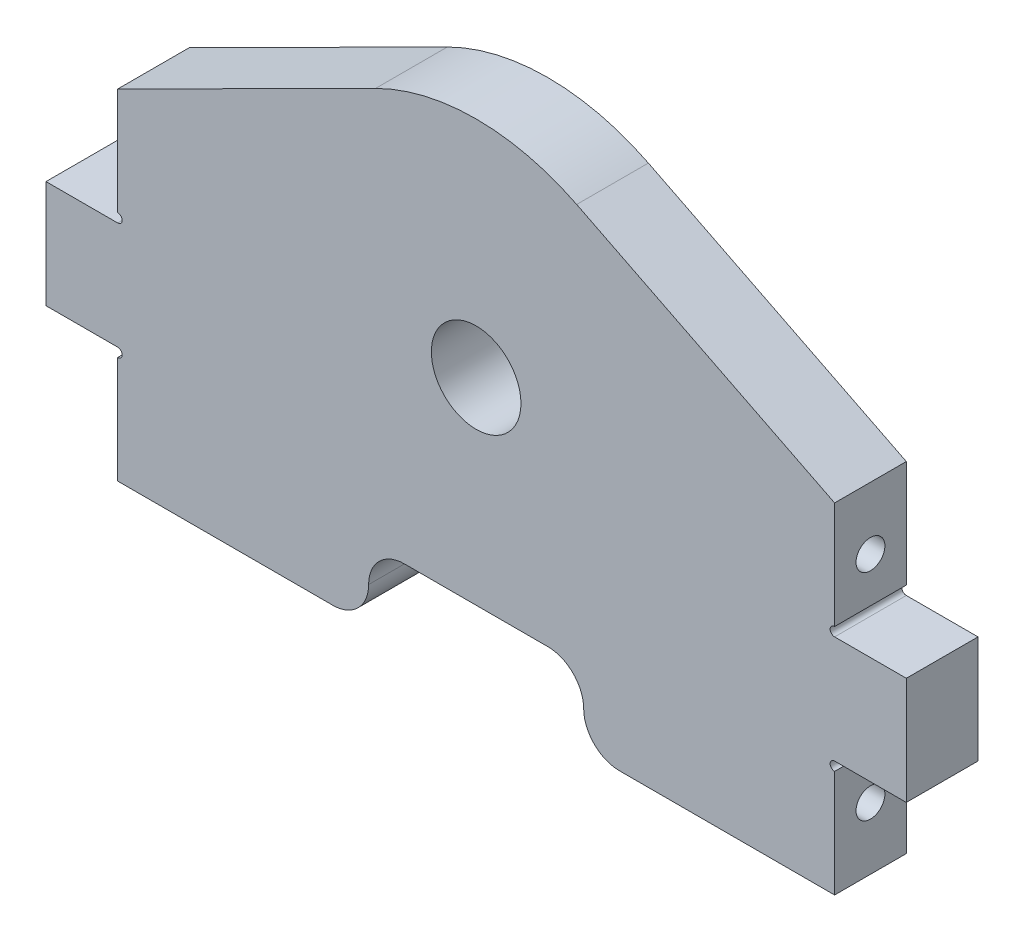
ISO-10303-21;
HEADER;
FILE_DESCRIPTION(('STEP AP214'),'2;1');
FILE_NAME('part.step','',(''),(''),'','','');
FILE_SCHEMA(('AUTOMOTIVE_DESIGN { 1 0 10303 214 1 1 1 1 }'));
ENDSEC;
DATA;
#1=APPLICATION_CONTEXT('core data for automotive mechanical design processes');
#2=APPLICATION_PROTOCOL_DEFINITION('international standard','automotive_design',2000,#1);
#3=PRODUCT_CONTEXT('',#1,'mechanical');
#4=PRODUCT('Part','Part','',(#3));
#5=PRODUCT_RELATED_PRODUCT_CATEGORY('part','',(#4));
#6=PRODUCT_DEFINITION_FORMATION('','',#4);
#7=PRODUCT_DEFINITION_CONTEXT('part definition',#1,'design');
#8=PRODUCT_DEFINITION('design','',#6,#7);
#9=PRODUCT_DEFINITION_SHAPE('','',#8);
#10=(LENGTH_UNIT() NAMED_UNIT(*) SI_UNIT(.MILLI.,.METRE.));
#11=(NAMED_UNIT(*) PLANE_ANGLE_UNIT() SI_UNIT($,.RADIAN.));
#12=(NAMED_UNIT(*) SI_UNIT($,.STERADIAN.) SOLID_ANGLE_UNIT());
#13=UNCERTAINTY_MEASURE_WITH_UNIT(LENGTH_MEASURE(1.E-05),#10,'distance_accuracy_value','');
#14=(GEOMETRIC_REPRESENTATION_CONTEXT(3) GLOBAL_UNCERTAINTY_ASSIGNED_CONTEXT((#13)) GLOBAL_UNIT_ASSIGNED_CONTEXT((#10,
#11,#12)) REPRESENTATION_CONTEXT('',''));
#15=CARTESIAN_POINT('',(0.,0.,0.));
#16=DIRECTION('',(0.,0.,1.));
#17=DIRECTION('',(1.,0.,0.));
#18=AXIS2_PLACEMENT_3D('',#15,#16,#17);
#19=CARTESIAN_POINT('',(0.,0.,12.7));
#20=DIRECTION('',(0.,0.,-1.));
#21=DIRECTION('',(-1.,0.,0.));
#22=AXIS2_PLACEMENT_3D('',#19,#20,#21);
#23=PLANE('',#22);
#24=CARTESIAN_POINT('',(-1.11022302462516E-13,44.45,12.7));
#25=DIRECTION('',(0.,0.,1.));
#26=DIRECTION('',(1.,0.,0.));
#27=AXIS2_PLACEMENT_3D('',#24,#25,#26);
#28=CIRCLE('',#27,7.9375);
#29=CARTESIAN_POINT('',(7.93749999999989,44.45,12.7));
#30=VERTEX_POINT('',#29);
#31=EDGE_CURVE('E350',#30,#30,#28,.T.);
#32=ORIENTED_EDGE('',*,*,#31,.F.);
#33=EDGE_LOOP('',(#32));
#34=FACE_BOUND('',#33,.T.);
#35=CARTESIAN_POINT('',(-63.5,16.5822501190821,12.7));
#36=DIRECTION('',(0.,0.,-1.));
#37=DIRECTION('',(-1.,0.,0.));
#38=AXIS2_PLACEMENT_3D('',#35,#36,#37);
#39=CIRCLE('',#38,0.793749999999993);
#40=CARTESIAN_POINT('',(-63.5,17.3760001190821,12.7));
#41=VERTEX_POINT('',#40);
#42=CARTESIAN_POINT('',(-63.5,15.7885001190821,12.7));
#43=VERTEX_POINT('',#42);
#44=EDGE_CURVE('E214',#41,#43,#39,.T.);
#45=ORIENTED_EDGE('',*,*,#44,.T.);
#46=DIRECTION('',(0.,-1.,0.));
#47=VECTOR('',#46,1.);
#48=CARTESIAN_POINT('',(-63.5,0.,12.7));
#49=LINE('',#48,#47);
#50=CARTESIAN_POINT('',(-63.5000000000001,-3.17500000000002,12.7));
#51=VERTEX_POINT('',#50);
#52=EDGE_CURVE('E225',#43,#51,#49,.T.);
#53=ORIENTED_EDGE('',*,*,#52,.T.);
#54=DIRECTION('',(-1.,0.,0.));
#55=VECTOR('',#54,1.);
#56=CARTESIAN_POINT('',(63.5,-3.17500000000002,12.7));
#57=LINE('',#56,#55);
#58=CARTESIAN_POINT('',(-25.4,-3.17500000000002,12.7));
#59=VERTEX_POINT('',#58);
#60=EDGE_CURVE('E345',#59,#51,#57,.T.);
#61=ORIENTED_EDGE('',*,*,#60,.F.);
#62=CARTESIAN_POINT('',(-25.4,3.17499999999998,12.7));
#63=DIRECTION('',(0.,0.,-1.));
#64=DIRECTION('',(-1.,0.,0.));
#65=AXIS2_PLACEMENT_3D('',#62,#63,#64);
#66=CIRCLE('',#65,6.35);
#67=CARTESIAN_POINT('',(-19.05,3.17499999999997,12.7));
#68=VERTEX_POINT('',#67);
#69=EDGE_CURVE('E402',#59,#68,#66,.F.);
#70=ORIENTED_EDGE('',*,*,#69,.T.);
#71=CARTESIAN_POINT('',(-12.7,3.17499999999998,12.7));
#72=DIRECTION('',(0.,0.,-1.));
#73=DIRECTION('',(-1.,0.,0.));
#74=AXIS2_PLACEMENT_3D('',#71,#72,#73);
#75=CIRCLE('',#74,6.35);
#76=CARTESIAN_POINT('',(-12.7,9.52499999999998,12.7));
#77=VERTEX_POINT('',#76);
#78=EDGE_CURVE('E416',#68,#77,#75,.T.);
#79=ORIENTED_EDGE('',*,*,#78,.T.);
#80=DIRECTION('',(-1.,0.,0.));
#81=VECTOR('',#80,1.);
#82=CARTESIAN_POINT('',(-19.05,9.52499999999998,12.7));
#83=LINE('',#82,#81);
#84=CARTESIAN_POINT('',(12.7,9.52499999999998,12.7));
#85=VERTEX_POINT('',#84);
#86=EDGE_CURVE('E338',#85,#77,#83,.T.);
#87=ORIENTED_EDGE('',*,*,#86,.F.);
#88=CARTESIAN_POINT('',(12.7,3.17499999999998,12.7));
#89=DIRECTION('',(0.,0.,-1.));
#90=DIRECTION('',(-1.,0.,0.));
#91=AXIS2_PLACEMENT_3D('',#88,#89,#90);
#92=CIRCLE('',#91,6.35);
#93=CARTESIAN_POINT('',(19.05,3.17499999999998,12.7));
#94=VERTEX_POINT('',#93);
#95=EDGE_CURVE('E45',#85,#94,#92,.T.);
#96=ORIENTED_EDGE('',*,*,#95,.T.);
#97=CARTESIAN_POINT('',(25.4,3.17499999999998,12.7));
#98=DIRECTION('',(0.,0.,-1.));
#99=DIRECTION('',(-1.,0.,0.));
#100=AXIS2_PLACEMENT_3D('',#97,#98,#99);
#101=CIRCLE('',#100,6.35);
#102=CARTESIAN_POINT('',(25.4,-3.17500000000002,12.7));
#103=VERTEX_POINT('',#102);
#104=EDGE_CURVE('E398',#94,#103,#101,.F.);
#105=ORIENTED_EDGE('',*,*,#104,.T.);
#106=CARTESIAN_POINT('',(63.5,-3.17500000000002,12.7));
#107=VERTEX_POINT('',#106);
#108=EDGE_CURVE('E341',#107,#103,#57,.T.);
#109=ORIENTED_EDGE('',*,*,#108,.F.);
#110=DIRECTION('',(0.,1.,0.));
#111=VECTOR('',#110,1.);
#112=CARTESIAN_POINT('',(63.5,0.,12.7));
#113=LINE('',#112,#111);
#114=CARTESIAN_POINT('',(63.5,15.7885001190821,12.7));
#115=VERTEX_POINT('',#114);
#116=EDGE_CURVE('E274',#107,#115,#113,.T.);
#117=ORIENTED_EDGE('',*,*,#116,.T.);
#118=CARTESIAN_POINT('',(63.5,16.5822501190821,12.7));
#119=DIRECTION('',(0.,0.,1.));
#120=DIRECTION('',(1.,0.,0.));
#121=AXIS2_PLACEMENT_3D('',#118,#119,#120);
#122=CIRCLE('',#121,0.793749999999993);
#123=CARTESIAN_POINT('',(63.5,17.3760001190821,12.7));
#124=VERTEX_POINT('',#123);
#125=EDGE_CURVE('E445',#124,#115,#122,.T.);
#126=ORIENTED_EDGE('',*,*,#125,.F.);
#127=DIRECTION('',(-1.,0.,0.));
#128=VECTOR('',#127,1.);
#129=CARTESIAN_POINT('',(76.2,17.3760001190821,12.7));
#130=LINE('',#129,#128);
#131=CARTESIAN_POINT('',(76.2,17.3760001190821,12.7));
#132=VERTEX_POINT('',#131);
#133=EDGE_CURVE('E311',#132,#124,#130,.T.);
#134=ORIENTED_EDGE('',*,*,#133,.F.);
#135=DIRECTION('',(0.,-1.,0.));
#136=VECTOR('',#135,1.);
#137=CARTESIAN_POINT('',(76.2,17.3760001190821,12.7));
#138=LINE('',#137,#136);
#139=CARTESIAN_POINT('',(76.2,36.4260001190821,12.7));
#140=VERTEX_POINT('',#139);
#141=EDGE_CURVE('E296',#140,#132,#138,.T.);
#142=ORIENTED_EDGE('',*,*,#141,.F.);
#143=DIRECTION('',(-1.,0.,0.));
#144=VECTOR('',#143,1.);
#145=CARTESIAN_POINT('',(76.2,36.4260001190821,12.7));
#146=LINE('',#145,#144);
#147=CARTESIAN_POINT('',(63.5,36.4260001190821,12.7));
#148=VERTEX_POINT('',#147);
#149=EDGE_CURVE('E299',#140,#148,#146,.T.);
#150=ORIENTED_EDGE('',*,*,#149,.T.);
#151=CARTESIAN_POINT('',(63.5,37.2197501190821,12.7));
#152=DIRECTION('',(0.,0.,1.));
#153=DIRECTION('',(1.,0.,0.));
#154=AXIS2_PLACEMENT_3D('',#151,#152,#153);
#155=CIRCLE('',#154,0.793749999999993);
#156=CARTESIAN_POINT('',(63.5,38.0135001190821,12.7));
#157=VERTEX_POINT('',#156);
#158=EDGE_CURVE('E53',#157,#148,#155,.T.);
#159=ORIENTED_EDGE('',*,*,#158,.F.);
#160=CARTESIAN_POINT('',(63.5,56.9770002381642,12.7));
#161=VERTEX_POINT('',#160);
#162=EDGE_CURVE('E238',#157,#161,#113,.T.);
#163=ORIENTED_EDGE('',*,*,#162,.T.);
#164=DIRECTION('',(-0.89368341057304,0.448698074061545,0.));
#165=VECTOR('',#164,1.);
#166=CARTESIAN_POINT('',(35.6318892320073,70.9689435610398,12.7));
#167=LINE('',#166,#165);
#168=CARTESIAN_POINT('',(17.8077048143174,79.9180603571175,12.7));
#169=VERTEX_POINT('',#168);
#170=EDGE_CURVE('E369',#161,#169,#167,.T.);
#171=ORIENTED_EDGE('',*,*,#170,.T.);
#172=CARTESIAN_POINT('',(-1.11022302462516E-13,44.45,12.7));
#173=DIRECTION('',(0.,0.,1.));
#174=DIRECTION('',(1.,0.,0.));
#175=AXIS2_PLACEMENT_3D('',#172,#173,#174);
#176=CIRCLE('',#175,39.6875);
#177=CARTESIAN_POINT('',(-17.8077048143177,79.9180603571175,12.7));
#178=VERTEX_POINT('',#177);
#179=EDGE_CURVE('E356',#169,#178,#176,.T.);
#180=ORIENTED_EDGE('',*,*,#179,.T.);
#181=DIRECTION('',(0.893683410573039,0.448698074061547,0.));
#182=VECTOR('',#181,1.);
#183=CARTESIAN_POINT('',(-35.6318892320074,70.9689435610398,12.7));
#184=LINE('',#183,#182);
#185=CARTESIAN_POINT('',(-63.5,56.9770002381641,12.7));
#186=VERTEX_POINT('',#185);
#187=EDGE_CURVE('E362',#186,#178,#184,.T.);
#188=ORIENTED_EDGE('',*,*,#187,.F.);
#189=CARTESIAN_POINT('',(-63.5,38.0135001190821,12.7));
#190=VERTEX_POINT('',#189);
#191=EDGE_CURVE('E235',#186,#190,#49,.T.);
#192=ORIENTED_EDGE('',*,*,#191,.T.);
#193=CARTESIAN_POINT('',(-63.5,37.2197501190821,12.7));
#194=DIRECTION('',(0.,0.,-1.));
#195=DIRECTION('',(-1.,0.,0.));
#196=AXIS2_PLACEMENT_3D('',#193,#194,#195);
#197=CIRCLE('',#196,0.793749999999993);
#198=CARTESIAN_POINT('',(-63.5,36.4260001190821,12.7));
#199=VERTEX_POINT('',#198);
#200=EDGE_CURVE('E221',#190,#199,#197,.T.);
#201=ORIENTED_EDGE('',*,*,#200,.T.);
#202=DIRECTION('',(1.,0.,0.));
#203=VECTOR('',#202,1.);
#204=CARTESIAN_POINT('',(-76.2,36.4260001190821,12.7));
#205=LINE('',#204,#203);
#206=CARTESIAN_POINT('',(-76.2,36.4260001190821,12.7));
#207=VERTEX_POINT('',#206);
#208=EDGE_CURVE('E481',#207,#199,#205,.T.);
#209=ORIENTED_EDGE('',*,*,#208,.F.);
#210=DIRECTION('',(0.,-1.,0.));
#211=VECTOR('',#210,1.);
#212=CARTESIAN_POINT('',(-76.2,17.3760001190821,12.7));
#213=LINE('',#212,#211);
#214=CARTESIAN_POINT('',(-76.2,17.3760001190821,12.7));
#215=VERTEX_POINT('',#214);
#216=EDGE_CURVE('E488',#207,#215,#213,.T.);
#217=ORIENTED_EDGE('',*,*,#216,.T.);
#218=DIRECTION('',(1.,0.,0.));
#219=VECTOR('',#218,1.);
#220=CARTESIAN_POINT('',(-76.2,17.3760001190821,12.7));
#221=LINE('',#220,#219);
#222=EDGE_CURVE('E228',#215,#41,#221,.T.);
#223=ORIENTED_EDGE('',*,*,#222,.T.);
#224=EDGE_LOOP('',(#45,#53,#61,#70,#79,#87,#96,#105,#109,#117,#126,#134,#142,#150,#159,#163,
#171,#180,#188,#192,#201,#209,#217,#223));
#225=FACE_BOUND('',#224,.T.);
#226=ADVANCED_FACE('F35',(#34,#225),#23,.F.);
#227=CARTESIAN_POINT('',(0.,0.,0.));
#228=DIRECTION('',(0.,0.,-1.));
#229=DIRECTION('',(-1.,0.,0.));
#230=AXIS2_PLACEMENT_3D('',#227,#228,#229);
#231=PLANE('',#230);
#232=CARTESIAN_POINT('',(-1.11022302462516E-13,44.45,0.));
#233=DIRECTION('',(0.,0.,1.));
#234=DIRECTION('',(1.,0.,0.));
#235=AXIS2_PLACEMENT_3D('',#232,#233,#234);
#236=CIRCLE('',#235,7.9375);
#237=CARTESIAN_POINT('',(7.93749999999989,44.45,0.));
#238=VERTEX_POINT('',#237);
#239=EDGE_CURVE('E353',#238,#238,#236,.T.);
#240=ORIENTED_EDGE('',*,*,#239,.T.);
#241=EDGE_LOOP('',(#240));
#242=FACE_BOUND('',#241,.T.);
#243=DIRECTION('',(0.,-1.,0.));
#244=VECTOR('',#243,1.);
#245=CARTESIAN_POINT('',(-63.5,0.,0.));
#246=LINE('',#245,#244);
#247=CARTESIAN_POINT('',(-63.5,15.7885001190821,0.));
#248=VERTEX_POINT('',#247);
#249=CARTESIAN_POINT('',(-63.5000000000001,-3.17500000000002,0.));
#250=VERTEX_POINT('',#249);
#251=EDGE_CURVE('E39',#248,#250,#246,.T.);
#252=ORIENTED_EDGE('',*,*,#251,.F.);
#253=CARTESIAN_POINT('',(-63.5,16.5822501190821,0.));
#254=DIRECTION('',(0.,0.,-1.));
#255=DIRECTION('',(-1.,0.,0.));
#256=AXIS2_PLACEMENT_3D('',#253,#254,#255);
#257=CIRCLE('',#256,0.793749999999993);
#258=CARTESIAN_POINT('',(-63.5,17.3760001190821,0.));
#259=VERTEX_POINT('',#258);
#260=EDGE_CURVE('E217',#248,#259,#257,.F.);
#261=ORIENTED_EDGE('',*,*,#260,.T.);
#262=DIRECTION('',(1.,0.,0.));
#263=VECTOR('',#262,1.);
#264=CARTESIAN_POINT('',(-76.2,17.3760001190821,0.));
#265=LINE('',#264,#263);
#266=CARTESIAN_POINT('',(-76.2,17.3760001190821,0.));
#267=VERTEX_POINT('',#266);
#268=EDGE_CURVE('E491',#267,#259,#265,.T.);
#269=ORIENTED_EDGE('',*,*,#268,.F.);
#270=DIRECTION('',(0.,1.,0.));
#271=VECTOR('',#270,1.);
#272=CARTESIAN_POINT('',(-76.2,17.3760001190821,0.));
#273=LINE('',#272,#271);
#274=CARTESIAN_POINT('',(-76.2,36.4260001190821,0.));
#275=VERTEX_POINT('',#274);
#276=EDGE_CURVE('E496',#267,#275,#273,.T.);
#277=ORIENTED_EDGE('',*,*,#276,.T.);
#278=DIRECTION('',(1.,0.,0.));
#279=VECTOR('',#278,1.);
#280=CARTESIAN_POINT('',(-76.2,36.4260001190821,0.));
#281=LINE('',#280,#279);
#282=CARTESIAN_POINT('',(-63.5,36.4260001190821,0.));
#283=VERTEX_POINT('',#282);
#284=EDGE_CURVE('E494',#275,#283,#281,.T.);
#285=ORIENTED_EDGE('',*,*,#284,.T.);
#286=CARTESIAN_POINT('',(-63.5,37.2197501190821,0.));
#287=DIRECTION('',(0.,0.,-1.));
#288=DIRECTION('',(-1.,0.,0.));
#289=AXIS2_PLACEMENT_3D('',#286,#287,#288);
#290=CIRCLE('',#289,0.793749999999993);
#291=CARTESIAN_POINT('',(-63.5,38.0135001190821,0.));
#292=VERTEX_POINT('',#291);
#293=EDGE_CURVE('E508',#283,#292,#290,.F.);
#294=ORIENTED_EDGE('',*,*,#293,.T.);
#295=CARTESIAN_POINT('',(-63.5,56.9770002381641,0.));
#296=VERTEX_POINT('',#295);
#297=EDGE_CURVE('E257',#296,#292,#246,.T.);
#298=ORIENTED_EDGE('',*,*,#297,.F.);
#299=DIRECTION('',(0.893683410573039,0.448698074061547,0.));
#300=VECTOR('',#299,1.);
#301=CARTESIAN_POINT('',(-35.6318892320074,70.9689435610398,0.));
#302=LINE('',#301,#300);
#303=CARTESIAN_POINT('',(-17.8077048143177,79.9180603571175,0.));
#304=VERTEX_POINT('',#303);
#305=EDGE_CURVE('E364',#296,#304,#302,.T.);
#306=ORIENTED_EDGE('',*,*,#305,.T.);
#307=CARTESIAN_POINT('',(-1.11022302462516E-13,44.45,0.));
#308=DIRECTION('',(0.,0.,1.));
#309=DIRECTION('',(1.,0.,0.));
#310=AXIS2_PLACEMENT_3D('',#307,#308,#309);
#311=CIRCLE('',#310,39.6875);
#312=CARTESIAN_POINT('',(17.8077048143174,79.9180603571175,0.));
#313=VERTEX_POINT('',#312);
#314=EDGE_CURVE('E359',#313,#304,#311,.T.);
#315=ORIENTED_EDGE('',*,*,#314,.F.);
#316=DIRECTION('',(-0.89368341057304,0.448698074061545,0.));
#317=VECTOR('',#316,1.);
#318=CARTESIAN_POINT('',(35.6318892320073,70.9689435610398,0.));
#319=LINE('',#318,#317);
#320=CARTESIAN_POINT('',(63.5,56.9770002381642,0.));
#321=VERTEX_POINT('',#320);
#322=EDGE_CURVE('E361',#321,#313,#319,.T.);
#323=ORIENTED_EDGE('',*,*,#322,.F.);
#324=DIRECTION('',(0.,1.,0.));
#325=VECTOR('',#324,1.);
#326=CARTESIAN_POINT('',(63.5,0.,0.));
#327=LINE('',#326,#325);
#328=CARTESIAN_POINT('',(63.5,38.0135001190821,0.));
#329=VERTEX_POINT('',#328);
#330=EDGE_CURVE('E241',#329,#321,#327,.T.);
#331=ORIENTED_EDGE('',*,*,#330,.F.);
#332=CARTESIAN_POINT('',(63.5,37.2197501190821,0.));
#333=DIRECTION('',(0.,0.,-1.));
#334=DIRECTION('',(-1.,0.,0.));
#335=AXIS2_PLACEMENT_3D('',#332,#333,#334);
#336=CIRCLE('',#335,0.793749999999993);
#337=CARTESIAN_POINT('',(63.5,36.4260001190821,0.));
#338=VERTEX_POINT('',#337);
#339=EDGE_CURVE('E443',#338,#329,#336,.T.);
#340=ORIENTED_EDGE('',*,*,#339,.F.);
#341=DIRECTION('',(-1.,0.,0.));
#342=VECTOR('',#341,1.);
#343=CARTESIAN_POINT('',(76.2,36.4260001190821,0.));
#344=LINE('',#343,#342);
#345=CARTESIAN_POINT('',(76.2,36.4260001190821,0.));
#346=VERTEX_POINT('',#345);
#347=EDGE_CURVE('E302',#346,#338,#344,.T.);
#348=ORIENTED_EDGE('',*,*,#347,.F.);
#349=DIRECTION('',(0.,1.,0.));
#350=VECTOR('',#349,1.);
#351=CARTESIAN_POINT('',(76.2,17.3760001190821,0.));
#352=LINE('',#351,#350);
#353=CARTESIAN_POINT('',(76.2,17.3760001190821,0.));
#354=VERTEX_POINT('',#353);
#355=EDGE_CURVE('E459',#354,#346,#352,.T.);
#356=ORIENTED_EDGE('',*,*,#355,.F.);
#357=DIRECTION('',(-1.,0.,0.));
#358=VECTOR('',#357,1.);
#359=CARTESIAN_POINT('',(76.2,17.3760001190821,0.));
#360=LINE('',#359,#358);
#361=CARTESIAN_POINT('',(63.5,17.3760001190821,0.));
#362=VERTEX_POINT('',#361);
#363=EDGE_CURVE('E282',#354,#362,#360,.T.);
#364=ORIENTED_EDGE('',*,*,#363,.T.);
#365=CARTESIAN_POINT('',(63.5,16.5822501190821,0.));
#366=DIRECTION('',(0.,0.,-1.));
#367=DIRECTION('',(-1.,0.,0.));
#368=AXIS2_PLACEMENT_3D('',#365,#366,#367);
#369=CIRCLE('',#368,0.793749999999993);
#370=CARTESIAN_POINT('',(63.5,15.7885001190821,0.));
#371=VERTEX_POINT('',#370);
#372=EDGE_CURVE('E436',#371,#362,#369,.T.);
#373=ORIENTED_EDGE('',*,*,#372,.F.);
#374=CARTESIAN_POINT('',(63.5,-3.17500000000002,0.));
#375=VERTEX_POINT('',#374);
#376=EDGE_CURVE('E236',#375,#371,#327,.T.);
#377=ORIENTED_EDGE('',*,*,#376,.F.);
#378=DIRECTION('',(-1.,0.,0.));
#379=VECTOR('',#378,1.);
#380=CARTESIAN_POINT('',(63.5,-3.17500000000002,0.));
#381=LINE('',#380,#379);
#382=CARTESIAN_POINT('',(25.4,-3.17500000000002,0.));
#383=VERTEX_POINT('',#382);
#384=EDGE_CURVE('E346',#375,#383,#381,.T.);
#385=ORIENTED_EDGE('',*,*,#384,.T.);
#386=CARTESIAN_POINT('',(25.4,3.17499999999998,0.));
#387=DIRECTION('',(0.,0.,-1.));
#388=DIRECTION('',(-1.,0.,0.));
#389=AXIS2_PLACEMENT_3D('',#386,#387,#388);
#390=CIRCLE('',#389,6.35);
#391=CARTESIAN_POINT('',(19.05,3.17499999999998,0.));
#392=VERTEX_POINT('',#391);
#393=EDGE_CURVE('E404',#383,#392,#390,.T.);
#394=ORIENTED_EDGE('',*,*,#393,.T.);
#395=CARTESIAN_POINT('',(12.7,3.17499999999998,0.));
#396=DIRECTION('',(0.,0.,-1.));
#397=DIRECTION('',(-1.,0.,0.));
#398=AXIS2_PLACEMENT_3D('',#395,#396,#397);
#399=CIRCLE('',#398,6.35);
#400=CARTESIAN_POINT('',(12.7,9.52499999999998,0.));
#401=VERTEX_POINT('',#400);
#402=EDGE_CURVE('E11',#392,#401,#399,.F.);
#403=ORIENTED_EDGE('',*,*,#402,.T.);
#404=DIRECTION('',(-1.,0.,0.));
#405=VECTOR('',#404,1.);
#406=CARTESIAN_POINT('',(-19.05,9.52499999999998,0.));
#407=LINE('',#406,#405);
#408=CARTESIAN_POINT('',(-12.7,9.52499999999998,0.));
#409=VERTEX_POINT('',#408);
#410=EDGE_CURVE('E335',#401,#409,#407,.T.);
#411=ORIENTED_EDGE('',*,*,#410,.T.);
#412=CARTESIAN_POINT('',(-12.7,3.17499999999998,0.));
#413=DIRECTION('',(0.,0.,-1.));
#414=DIRECTION('',(-1.,0.,0.));
#415=AXIS2_PLACEMENT_3D('',#412,#413,#414);
#416=CIRCLE('',#415,6.35);
#417=CARTESIAN_POINT('',(-19.05,3.17499999999997,0.));
#418=VERTEX_POINT('',#417);
#419=EDGE_CURVE('E418',#409,#418,#416,.F.);
#420=ORIENTED_EDGE('',*,*,#419,.T.);
#421=CARTESIAN_POINT('',(-25.4,3.17499999999998,0.));
#422=DIRECTION('',(0.,0.,-1.));
#423=DIRECTION('',(-1.,0.,0.));
#424=AXIS2_PLACEMENT_3D('',#421,#422,#423);
#425=CIRCLE('',#424,6.35);
#426=CARTESIAN_POINT('',(-25.4,-3.17500000000002,0.));
#427=VERTEX_POINT('',#426);
#428=EDGE_CURVE('E408',#418,#427,#425,.T.);
#429=ORIENTED_EDGE('',*,*,#428,.T.);
#430=EDGE_CURVE('E337',#427,#250,#381,.T.);
#431=ORIENTED_EDGE('',*,*,#430,.T.);
#432=EDGE_LOOP('',(#252,#261,#269,#277,#285,#294,#298,#306,#315,#323,#331,#340,#348,#356,#364,
#373,#377,#385,#394,#403,#411,#420,#429,#431));
#433=FACE_BOUND('',#432,.T.);
#434=ADVANCED_FACE('F435',(#242,#433),#231,.T.);
#435=CARTESIAN_POINT('',(-63.5,0.,12.7));
#436=DIRECTION('',(1.,0.,0.));
#437=DIRECTION('',(0.,0.,-1.));
#438=AXIS2_PLACEMENT_3D('',#435,#436,#437);
#439=PLANE('',#438);
#440=CARTESIAN_POINT('',(-63.5,7.85100011908207,6.35));
#441=DIRECTION('',(-1.,0.,0.));
#442=DIRECTION('',(0.,0.,1.));
#443=AXIS2_PLACEMENT_3D('',#440,#441,#442);
#444=CIRCLE('',#443,2.55269999999999);
#445=CARTESIAN_POINT('',(-63.5,7.85100011908207,8.90269999999999));
#446=VERTEX_POINT('',#445);
#447=EDGE_CURVE('E468',#446,#446,#444,.T.);
#448=ORIENTED_EDGE('',*,*,#447,.F.);
#449=EDGE_LOOP('',(#448));
#450=FACE_BOUND('',#449,.T.);
#451=DIRECTION('',(0.,0.,1.));
#452=VECTOR('',#451,1.);
#453=CARTESIAN_POINT('',(-63.5,15.7885001190821,-4.99999999997031E-05));
#454=LINE('',#453,#452);
#455=EDGE_CURVE('E211',#248,#43,#454,.T.);
#456=ORIENTED_EDGE('',*,*,#455,.F.);
#457=ORIENTED_EDGE('',*,*,#251,.T.);
#458=DIRECTION('',(0.,0.,-1.));
#459=VECTOR('',#458,1.);
#460=CARTESIAN_POINT('',(-63.5000000000001,-3.17500000000002,12.7));
#461=LINE('',#460,#459);
#462=EDGE_CURVE('E234',#51,#250,#461,.T.);
#463=ORIENTED_EDGE('',*,*,#462,.F.);
#464=ORIENTED_EDGE('',*,*,#52,.F.);
#465=EDGE_LOOP('',(#456,#457,#463,#464));
#466=FACE_BOUND('',#465,.T.);
#467=ADVANCED_FACE('F232',(#450,#466),#439,.F.);
#468=CARTESIAN_POINT('',(-63.5,45.9510001190821,6.35));
#469=DIRECTION('',(-1.,0.,0.));
#470=DIRECTION('',(0.,0.,1.));
#471=AXIS2_PLACEMENT_3D('',#468,#469,#470);
#472=CIRCLE('',#471,2.55269999999999);
#473=CARTESIAN_POINT('',(-63.5,45.9510001190821,8.90269999999999));
#474=VERTEX_POINT('',#473);
#475=EDGE_CURVE('E478',#474,#474,#472,.T.);
#476=ORIENTED_EDGE('',*,*,#475,.F.);
#477=EDGE_LOOP('',(#476));
#478=FACE_BOUND('',#477,.T.);
#479=DIRECTION('',(0.,0.,1.));
#480=VECTOR('',#479,1.);
#481=CARTESIAN_POINT('',(-63.5,38.0135001190821,-4.99999999997031E-05));
#482=LINE('',#481,#480);
#483=EDGE_CURVE('E506',#190,#292,#482,.F.);
#484=ORIENTED_EDGE('',*,*,#483,.F.);
#485=ORIENTED_EDGE('',*,*,#191,.F.);
#486=DIRECTION('',(0.,0.,1.));
#487=VECTOR('',#486,1.);
#488=CARTESIAN_POINT('',(-63.5,56.9770002381641,0.));
#489=LINE('',#488,#487);
#490=EDGE_CURVE('E376',#296,#186,#489,.T.);
#491=ORIENTED_EDGE('',*,*,#490,.F.);
#492=ORIENTED_EDGE('',*,*,#297,.T.);
#493=EDGE_LOOP('',(#484,#485,#491,#492));
#494=FACE_BOUND('',#493,.T.);
#495=ADVANCED_FACE('F541',(#478,#494),#439,.F.);
#496=CARTESIAN_POINT('',(63.5,0.,12.7));
#497=DIRECTION('',(-1.,0.,0.));
#498=DIRECTION('',(0.,0.,1.));
#499=AXIS2_PLACEMENT_3D('',#496,#497,#498);
#500=PLANE('',#499);
#501=CARTESIAN_POINT('',(63.5,45.9510001190821,6.35));
#502=DIRECTION('',(1.,0.,0.));
#503=DIRECTION('',(0.,0.,-1.));
#504=AXIS2_PLACEMENT_3D('',#501,#502,#503);
#505=CIRCLE('',#504,2.55269999999999);
#506=CARTESIAN_POINT('',(63.5,45.9510001190821,3.79730000000001));
#507=VERTEX_POINT('',#506);
#508=EDGE_CURVE('E291',#507,#507,#505,.T.);
#509=ORIENTED_EDGE('',*,*,#508,.F.);
#510=EDGE_LOOP('',(#509));
#511=FACE_BOUND('',#510,.T.);
#512=ORIENTED_EDGE('',*,*,#162,.F.);
#513=DIRECTION('',(0.,0.,1.));
#514=VECTOR('',#513,1.);
#515=CARTESIAN_POINT('',(63.5,38.0135001190821,-4.99999999997031E-05));
#516=LINE('',#515,#514);
#517=EDGE_CURVE('E281',#157,#329,#516,.F.);
#518=ORIENTED_EDGE('',*,*,#517,.T.);
#519=ORIENTED_EDGE('',*,*,#330,.T.);
#520=DIRECTION('',(0.,0.,1.));
#521=VECTOR('',#520,1.);
#522=CARTESIAN_POINT('',(63.5,56.9770002381642,0.));
#523=LINE('',#522,#521);
#524=EDGE_CURVE('E377',#321,#161,#523,.T.);
#525=ORIENTED_EDGE('',*,*,#524,.T.);
#526=EDGE_LOOP('',(#512,#518,#519,#525));
#527=FACE_BOUND('',#526,.T.);
#528=ADVANCED_FACE('F566',(#511,#527),#500,.F.);
#529=CARTESIAN_POINT('',(63.5,7.85100011908207,6.35));
#530=DIRECTION('',(1.,0.,0.));
#531=DIRECTION('',(0.,0.,-1.));
#532=AXIS2_PLACEMENT_3D('',#529,#530,#531);
#533=CIRCLE('',#532,2.55269999999999);
#534=CARTESIAN_POINT('',(63.5,7.85100011908207,3.79730000000001));
#535=VERTEX_POINT('',#534);
#536=EDGE_CURVE('E325',#535,#535,#533,.T.);
#537=ORIENTED_EDGE('',*,*,#536,.F.);
#538=EDGE_LOOP('',(#537));
#539=FACE_BOUND('',#538,.T.);
#540=ORIENTED_EDGE('',*,*,#376,.T.);
#541=DIRECTION('',(0.,0.,1.));
#542=VECTOR('',#541,1.);
#543=CARTESIAN_POINT('',(63.5,15.7885001190821,-4.99999999997031E-05));
#544=LINE('',#543,#542);
#545=EDGE_CURVE('E440',#371,#115,#544,.T.);
#546=ORIENTED_EDGE('',*,*,#545,.T.);
#547=ORIENTED_EDGE('',*,*,#116,.F.);
#548=DIRECTION('',(0.,0.,-1.));
#549=VECTOR('',#548,1.);
#550=CARTESIAN_POINT('',(63.5,-3.17500000000002,12.7));
#551=LINE('',#550,#549);
#552=EDGE_CURVE('E344',#107,#375,#551,.T.);
#553=ORIENTED_EDGE('',*,*,#552,.T.);
#554=EDGE_LOOP('',(#540,#546,#547,#553));
#555=FACE_BOUND('',#554,.T.);
#556=ADVANCED_FACE('F439',(#539,#555),#500,.F.);
#557=CARTESIAN_POINT('',(63.5,-3.17500000000002,12.7));
#558=DIRECTION('',(0.,-1.,0.));
#559=DIRECTION('',(0.,0.,-1.));
#560=AXIS2_PLACEMENT_3D('',#557,#558,#559);
#561=PLANE('',#560);
#562=ORIENTED_EDGE('',*,*,#430,.F.);
#563=DIRECTION('',(0.,0.,1.));
#564=VECTOR('',#563,1.);
#565=CARTESIAN_POINT('',(-25.4,-3.17500000000002,12.7));
#566=LINE('',#565,#564);
#567=EDGE_CURVE('E268',#427,#59,#566,.T.);
#568=ORIENTED_EDGE('',*,*,#567,.T.);
#569=ORIENTED_EDGE('',*,*,#60,.T.);
#570=ORIENTED_EDGE('',*,*,#462,.T.);
#571=EDGE_LOOP('',(#562,#568,#569,#570));
#572=FACE_BOUND('',#571,.T.);
#573=ADVANCED_FACE('F552',(#572),#561,.T.);
#574=CARTESIAN_POINT('',(-1.11022302462516E-13,44.45,0.));
#575=DIRECTION('',(0.,0.,1.));
#576=DIRECTION('',(1.,0.,0.));
#577=AXIS2_PLACEMENT_3D('',#574,#575,#576);
#578=CYLINDRICAL_SURFACE('',#577,39.6875);
#579=ORIENTED_EDGE('',*,*,#179,.F.);
#580=DIRECTION('',(0.,0.,1.));
#581=VECTOR('',#580,1.);
#582=CARTESIAN_POINT('',(17.8077048143174,79.9180603571175,0.));
#583=LINE('',#582,#581);
#584=EDGE_CURVE('E250',#313,#169,#583,.T.);
#585=ORIENTED_EDGE('',*,*,#584,.F.);
#586=ORIENTED_EDGE('',*,*,#314,.T.);
#587=DIRECTION('',(0.,0.,1.));
#588=VECTOR('',#587,1.);
#589=CARTESIAN_POINT('',(-17.8077048143177,79.9180603571175,0.));
#590=LINE('',#589,#588);
#591=EDGE_CURVE('E374',#304,#178,#590,.T.);
#592=ORIENTED_EDGE('',*,*,#591,.T.);
#593=EDGE_LOOP('',(#579,#585,#586,#592));
#594=FACE_BOUND('',#593,.T.);
#595=ADVANCED_FACE('F390',(#594),#578,.T.);
#596=CARTESIAN_POINT('',(-35.6318892320074,70.9689435610398,0.));
#597=DIRECTION('',(0.448698074061547,-0.893683410573039,0.));
#598=DIRECTION('',(0.893683410573039,0.448698074061547,0.));
#599=AXIS2_PLACEMENT_3D('',#596,#597,#598);
#600=PLANE('',#599);
#601=ORIENTED_EDGE('',*,*,#187,.T.);
#602=ORIENTED_EDGE('',*,*,#591,.F.);
#603=ORIENTED_EDGE('',*,*,#305,.F.);
#604=ORIENTED_EDGE('',*,*,#490,.T.);
#605=EDGE_LOOP('',(#601,#602,#603,#604));
#606=FACE_BOUND('',#605,.T.);
#607=ADVANCED_FACE('F543',(#606),#600,.F.);
#608=CARTESIAN_POINT('',(35.6318892320073,70.9689435610398,0.));
#609=DIRECTION('',(0.448698074061545,0.89368341057304,0.));
#610=DIRECTION('',(-0.89368341057304,0.448698074061545,0.));
#611=AXIS2_PLACEMENT_3D('',#608,#609,#610);
#612=PLANE('',#611);
#613=ORIENTED_EDGE('',*,*,#170,.F.);
#614=ORIENTED_EDGE('',*,*,#524,.F.);
#615=ORIENTED_EDGE('',*,*,#322,.T.);
#616=ORIENTED_EDGE('',*,*,#584,.T.);
#617=EDGE_LOOP('',(#613,#614,#615,#616));
#618=FACE_BOUND('',#617,.T.);
#619=ADVANCED_FACE('F386',(#618),#612,.T.);
#620=CARTESIAN_POINT('',(-1.11022302462516E-13,44.45,0.));
#621=DIRECTION('',(0.,0.,1.));
#622=DIRECTION('',(1.,0.,0.));
#623=AXIS2_PLACEMENT_3D('',#620,#621,#622);
#624=CYLINDRICAL_SURFACE('',#623,7.9375);
#625=ORIENTED_EDGE('',*,*,#239,.F.);
#626=EDGE_LOOP('',(#625));
#627=FACE_BOUND('',#626,.T.);
#628=ORIENTED_EDGE('',*,*,#31,.T.);
#629=EDGE_LOOP('',(#628));
#630=FACE_BOUND('',#629,.T.);
#631=ADVANCED_FACE('F550',(#627,#630),#624,.F.);
#632=ORIENTED_EDGE('',*,*,#108,.T.);
#633=DIRECTION('',(0.,0.,1.));
#634=VECTOR('',#633,1.);
#635=CARTESIAN_POINT('',(25.4,-3.17500000000002,0.));
#636=LINE('',#635,#634);
#637=EDGE_CURVE('E414',#103,#383,#636,.F.);
#638=ORIENTED_EDGE('',*,*,#637,.T.);
#639=ORIENTED_EDGE('',*,*,#384,.F.);
#640=ORIENTED_EDGE('',*,*,#552,.F.);
#641=EDGE_LOOP('',(#632,#638,#639,#640));
#642=FACE_BOUND('',#641,.T.);
#643=ADVANCED_FACE('F433',(#642),#561,.T.);
#644=CARTESIAN_POINT('',(-19.05,9.52499999999998,0.));
#645=DIRECTION('',(0.,1.,0.));
#646=DIRECTION('',(0.,0.,1.));
#647=AXIS2_PLACEMENT_3D('',#644,#645,#646);
#648=PLANE('',#647);
#649=ORIENTED_EDGE('',*,*,#86,.T.);
#650=DIRECTION('',(0.,0.,1.));
#651=VECTOR('',#650,1.);
#652=CARTESIAN_POINT('',(-12.7,9.52499999999998,0.));
#653=LINE('',#652,#651);
#654=EDGE_CURVE('E61',#77,#409,#653,.F.);
#655=ORIENTED_EDGE('',*,*,#654,.T.);
#656=ORIENTED_EDGE('',*,*,#410,.F.);
#657=DIRECTION('',(0.,0.,1.));
#658=VECTOR('',#657,1.);
#659=CARTESIAN_POINT('',(12.7,9.52499999999998,12.7));
#660=LINE('',#659,#658);
#661=EDGE_CURVE('E410',#401,#85,#660,.T.);
#662=ORIENTED_EDGE('',*,*,#661,.T.);
#663=EDGE_LOOP('',(#649,#655,#656,#662));
#664=FACE_BOUND('',#663,.T.);
#665=ADVANCED_FACE('F579',(#664),#648,.F.);
#666=CARTESIAN_POINT('',(-12.7,3.17499999999998,0.));
#667=DIRECTION('',(0.,0.,-1.));
#668=DIRECTION('',(-1.,0.,0.));
#669=AXIS2_PLACEMENT_3D('',#666,#667,#668);
#670=CYLINDRICAL_SURFACE('',#669,6.35);
#671=DIRECTION('',(0.,0.,1.));
#672=VECTOR('',#671,1.);
#673=CARTESIAN_POINT('',(-19.05,3.17499999999998,12.7));
#674=LINE('',#673,#672);
#675=EDGE_CURVE('E340',#418,#68,#674,.T.);
#676=ORIENTED_EDGE('',*,*,#675,.F.);
#677=ORIENTED_EDGE('',*,*,#419,.F.);
#678=ORIENTED_EDGE('',*,*,#654,.F.);
#679=ORIENTED_EDGE('',*,*,#78,.F.);
#680=EDGE_LOOP('',(#676,#677,#678,#679));
#681=FACE_BOUND('',#680,.T.);
#682=ADVANCED_FACE('F576',(#681),#670,.F.);
#683=CARTESIAN_POINT('',(-25.4,3.17499999999998,12.7));
#684=DIRECTION('',(0.,0.,-1.));
#685=DIRECTION('',(-1.,0.,0.));
#686=AXIS2_PLACEMENT_3D('',#683,#684,#685);
#687=CYLINDRICAL_SURFACE('',#686,6.35);
#688=ORIENTED_EDGE('',*,*,#428,.F.);
#689=ORIENTED_EDGE('',*,*,#675,.T.);
#690=ORIENTED_EDGE('',*,*,#69,.F.);
#691=ORIENTED_EDGE('',*,*,#567,.F.);
#692=EDGE_LOOP('',(#688,#689,#690,#691));
#693=FACE_BOUND('',#692,.T.);
#694=ADVANCED_FACE('F573',(#693),#687,.T.);
#695=CARTESIAN_POINT('',(25.4,3.17499999999998,0.));
#696=DIRECTION('',(0.,0.,-1.));
#697=DIRECTION('',(-1.,0.,0.));
#698=AXIS2_PLACEMENT_3D('',#695,#696,#697);
#699=CYLINDRICAL_SURFACE('',#698,6.35);
#700=DIRECTION('',(0.,0.,1.));
#701=VECTOR('',#700,1.);
#702=CARTESIAN_POINT('',(19.05,3.17499999999998,12.7));
#703=LINE('',#702,#701);
#704=EDGE_CURVE('E334',#392,#94,#703,.T.);
#705=ORIENTED_EDGE('',*,*,#704,.F.);
#706=ORIENTED_EDGE('',*,*,#393,.F.);
#707=ORIENTED_EDGE('',*,*,#637,.F.);
#708=ORIENTED_EDGE('',*,*,#104,.F.);
#709=EDGE_LOOP('',(#705,#706,#707,#708));
#710=FACE_BOUND('',#709,.T.);
#711=ADVANCED_FACE('F37',(#710),#699,.T.);
#712=CARTESIAN_POINT('',(12.7,3.17499999999998,0.));
#713=DIRECTION('',(0.,0.,-1.));
#714=DIRECTION('',(-1.,0.,0.));
#715=AXIS2_PLACEMENT_3D('',#712,#713,#714);
#716=CYLINDRICAL_SURFACE('',#715,6.35);
#717=ORIENTED_EDGE('',*,*,#402,.F.);
#718=ORIENTED_EDGE('',*,*,#704,.T.);
#719=ORIENTED_EDGE('',*,*,#95,.F.);
#720=ORIENTED_EDGE('',*,*,#661,.F.);
#721=EDGE_LOOP('',(#717,#718,#719,#720));
#722=FACE_BOUND('',#721,.T.);
#723=ADVANCED_FACE('F426',(#722),#716,.F.);
#724=CARTESIAN_POINT('',(46.99,7.85100011908207,6.35));
#725=DIRECTION('',(1.,0.,0.));
#726=DIRECTION('',(0.,0.,-1.));
#727=AXIS2_PLACEMENT_3D('',#724,#725,#726);
#728=CONICAL_SURFACE('',#727,2.55269999999999,1.02974425867665);
#729=CARTESIAN_POINT('',(45.4561830978084,7.85100011908207,6.35));
#730=VERTEX_POINT('',#729);
#731=VERTEX_LOOP('',#730);
#732=FACE_BOUND('',#731,.T.);
#733=CARTESIAN_POINT('',(46.99,7.85100011908207,6.35));
#734=DIRECTION('',(1.,0.,0.));
#735=DIRECTION('',(0.,0.,-1.));
#736=AXIS2_PLACEMENT_3D('',#733,#734,#735);
#737=CIRCLE('',#736,2.55269999999999);
#738=CARTESIAN_POINT('',(46.99,7.85100011908207,3.79730000000001));
#739=VERTEX_POINT('',#738);
#740=EDGE_CURVE('E329',#739,#739,#737,.T.);
#741=ORIENTED_EDGE('',*,*,#740,.T.);
#742=EDGE_LOOP('',(#741));
#743=FACE_BOUND('',#742,.T.);
#744=ADVANCED_FACE('F582',(#732,#743),#728,.F.);
#745=CARTESIAN_POINT('',(63.5,7.85100011908207,6.35));
#746=DIRECTION('',(1.,0.,0.));
#747=DIRECTION('',(0.,0.,-1.));
#748=AXIS2_PLACEMENT_3D('',#745,#746,#747);
#749=CYLINDRICAL_SURFACE('',#748,2.55269999999999);
#750=ORIENTED_EDGE('',*,*,#740,.F.);
#751=EDGE_LOOP('',(#750));
#752=FACE_BOUND('',#751,.T.);
#753=ORIENTED_EDGE('',*,*,#536,.T.);
#754=EDGE_LOOP('',(#753));
#755=FACE_BOUND('',#754,.T.);
#756=ADVANCED_FACE('F588',(#752,#755),#749,.F.);
#757=CARTESIAN_POINT('',(46.99,45.9510001190821,6.35));
#758=DIRECTION('',(1.,0.,0.));
#759=DIRECTION('',(0.,0.,-1.));
#760=AXIS2_PLACEMENT_3D('',#757,#758,#759);
#761=CONICAL_SURFACE('',#760,2.55269999999998,1.02974425867665);
#762=CARTESIAN_POINT('',(45.4561830978084,45.9510001190821,6.35));
#763=VERTEX_POINT('',#762);
#764=VERTEX_LOOP('',#763);
#765=FACE_BOUND('',#764,.T.);
#766=CARTESIAN_POINT('',(46.99,45.9510001190821,6.35));
#767=DIRECTION('',(1.,0.,0.));
#768=DIRECTION('',(0.,0.,-1.));
#769=AXIS2_PLACEMENT_3D('',#766,#767,#768);
#770=CIRCLE('',#769,2.55269999999998);
#771=CARTESIAN_POINT('',(46.99,45.9510001190821,3.79730000000002));
#772=VERTEX_POINT('',#771);
#773=EDGE_CURVE('E320',#772,#772,#770,.T.);
#774=ORIENTED_EDGE('',*,*,#773,.T.);
#775=EDGE_LOOP('',(#774));
#776=FACE_BOUND('',#775,.T.);
#777=ADVANCED_FACE('F653',(#765,#776),#761,.F.);
#778=CARTESIAN_POINT('',(63.5,45.9510001190821,6.35));
#779=DIRECTION('',(1.,0.,0.));
#780=DIRECTION('',(0.,0.,-1.));
#781=AXIS2_PLACEMENT_3D('',#778,#779,#780);
#782=CYLINDRICAL_SURFACE('',#781,2.55269999999999);
#783=ORIENTED_EDGE('',*,*,#773,.F.);
#784=EDGE_LOOP('',(#783));
#785=FACE_BOUND('',#784,.T.);
#786=ORIENTED_EDGE('',*,*,#508,.T.);
#787=EDGE_LOOP('',(#786));
#788=FACE_BOUND('',#787,.T.);
#789=ADVANCED_FACE('F657',(#785,#788),#782,.F.);
#790=CARTESIAN_POINT('',(76.2,17.3760001190821,12.7));
#791=DIRECTION('',(0.,1.,0.));
#792=DIRECTION('',(0.,0.,1.));
#793=AXIS2_PLACEMENT_3D('',#790,#791,#792);
#794=PLANE('',#793);
#795=DIRECTION('',(0.,0.,-1.));
#796=VECTOR('',#795,1.);
#797=CARTESIAN_POINT('',(63.5,17.3760001190821,12.7));
#798=LINE('',#797,#796);
#799=EDGE_CURVE('E276',#124,#362,#798,.T.);
#800=ORIENTED_EDGE('',*,*,#799,.T.);
#801=ORIENTED_EDGE('',*,*,#363,.F.);
#802=DIRECTION('',(0.,0.,-1.));
#803=VECTOR('',#802,1.);
#804=CARTESIAN_POINT('',(76.2,17.3760001190821,12.7));
#805=LINE('',#804,#803);
#806=EDGE_CURVE('E458',#132,#354,#805,.T.);
#807=ORIENTED_EDGE('',*,*,#806,.F.);
#808=ORIENTED_EDGE('',*,*,#133,.T.);
#809=EDGE_LOOP('',(#800,#801,#807,#808));
#810=FACE_BOUND('',#809,.T.);
#811=ADVANCED_FACE('F661',(#810),#794,.F.);
#812=CARTESIAN_POINT('',(76.2,36.4260001190821,12.7));
#813=DIRECTION('',(0.,-1.,0.));
#814=DIRECTION('',(0.,0.,-1.));
#815=AXIS2_PLACEMENT_3D('',#812,#813,#814);
#816=PLANE('',#815);
#817=DIRECTION('',(0.,0.,1.));
#818=VECTOR('',#817,1.);
#819=CARTESIAN_POINT('',(63.5,36.4260001190821,12.7));
#820=LINE('',#819,#818);
#821=EDGE_CURVE('E280',#338,#148,#820,.T.);
#822=ORIENTED_EDGE('',*,*,#821,.T.);
#823=ORIENTED_EDGE('',*,*,#149,.F.);
#824=DIRECTION('',(0.,0.,1.));
#825=VECTOR('',#824,1.);
#826=CARTESIAN_POINT('',(76.2,36.4260001190821,12.7));
#827=LINE('',#826,#825);
#828=EDGE_CURVE('E287',#346,#140,#827,.T.);
#829=ORIENTED_EDGE('',*,*,#828,.F.);
#830=ORIENTED_EDGE('',*,*,#347,.T.);
#831=EDGE_LOOP('',(#822,#823,#829,#830));
#832=FACE_BOUND('',#831,.T.);
#833=ADVANCED_FACE('F464',(#832),#816,.F.);
#834=CARTESIAN_POINT('',(76.2,0.,0.));
#835=DIRECTION('',(-1.,0.,0.));
#836=DIRECTION('',(0.,0.,1.));
#837=AXIS2_PLACEMENT_3D('',#834,#835,#836);
#838=PLANE('',#837);
#839=ORIENTED_EDGE('',*,*,#141,.T.);
#840=ORIENTED_EDGE('',*,*,#806,.T.);
#841=ORIENTED_EDGE('',*,*,#355,.T.);
#842=ORIENTED_EDGE('',*,*,#828,.T.);
#843=EDGE_LOOP('',(#839,#840,#841,#842));
#844=FACE_BOUND('',#843,.T.);
#845=ADVANCED_FACE('F462',(#844),#838,.F.);
#846=CARTESIAN_POINT('',(63.5,37.2197501190821,-4.99999999997031E-05));
#847=DIRECTION('',(0.,0.,1.));
#848=DIRECTION('',(1.,0.,0.));
#849=AXIS2_PLACEMENT_3D('',#846,#847,#848);
#850=CYLINDRICAL_SURFACE('',#849,0.793749999999993);
#851=ORIENTED_EDGE('',*,*,#158,.T.);
#852=ORIENTED_EDGE('',*,*,#821,.F.);
#853=ORIENTED_EDGE('',*,*,#339,.T.);
#854=ORIENTED_EDGE('',*,*,#517,.F.);
#855=EDGE_LOOP('',(#851,#852,#853,#854));
#856=FACE_BOUND('',#855,.T.);
#857=ADVANCED_FACE('F669',(#856),#850,.F.);
#858=CARTESIAN_POINT('',(63.5,16.5822501190821,-4.99999999997031E-05));
#859=DIRECTION('',(0.,0.,1.));
#860=DIRECTION('',(1.,0.,0.));
#861=AXIS2_PLACEMENT_3D('',#858,#859,#860);
#862=CYLINDRICAL_SURFACE('',#861,0.793749999999993);
#863=ORIENTED_EDGE('',*,*,#372,.T.);
#864=ORIENTED_EDGE('',*,*,#799,.F.);
#865=ORIENTED_EDGE('',*,*,#125,.T.);
#866=ORIENTED_EDGE('',*,*,#545,.F.);
#867=EDGE_LOOP('',(#863,#864,#865,#866));
#868=FACE_BOUND('',#867,.T.);
#869=ADVANCED_FACE('F672',(#868),#862,.F.);
#870=CARTESIAN_POINT('',(-46.99,7.85100011908207,6.35));
#871=DIRECTION('',(-1.,0.,0.));
#872=DIRECTION('',(0.,0.,1.));
#873=AXIS2_PLACEMENT_3D('',#870,#871,#872);
#874=CONICAL_SURFACE('',#873,2.55269999999999,1.02974425867665);
#875=CARTESIAN_POINT('',(-45.4561830978084,7.85100011908207,6.35));
#876=VERTEX_POINT('',#875);
#877=VERTEX_LOOP('',#876);
#878=FACE_BOUND('',#877,.T.);
#879=CARTESIAN_POINT('',(-46.99,7.85100011908207,6.35));
#880=DIRECTION('',(-1.,0.,0.));
#881=DIRECTION('',(0.,0.,1.));
#882=AXIS2_PLACEMENT_3D('',#879,#880,#881);
#883=CIRCLE('',#882,2.55269999999999);
#884=CARTESIAN_POINT('',(-46.99,7.85100011908207,8.90269999999999));
#885=VERTEX_POINT('',#884);
#886=EDGE_CURVE('E465',#885,#885,#883,.T.);
#887=ORIENTED_EDGE('',*,*,#886,.T.);
#888=EDGE_LOOP('',(#887));
#889=FACE_BOUND('',#888,.T.);
#890=ADVANCED_FACE('F675',(#878,#889),#874,.F.);
#891=CARTESIAN_POINT('',(-63.5,7.85100011908207,6.35));
#892=DIRECTION('',(-1.,0.,0.));
#893=DIRECTION('',(0.,0.,1.));
#894=AXIS2_PLACEMENT_3D('',#891,#892,#893);
#895=CYLINDRICAL_SURFACE('',#894,2.55269999999999);
#896=ORIENTED_EDGE('',*,*,#886,.F.);
#897=EDGE_LOOP('',(#896));
#898=FACE_BOUND('',#897,.T.);
#899=ORIENTED_EDGE('',*,*,#447,.T.);
#900=EDGE_LOOP('',(#899));
#901=FACE_BOUND('',#900,.T.);
#902=ADVANCED_FACE('F678',(#898,#901),#895,.F.);
#903=CARTESIAN_POINT('',(-46.99,45.9510001190821,6.35));
#904=DIRECTION('',(-1.,0.,0.));
#905=DIRECTION('',(0.,0.,1.));
#906=AXIS2_PLACEMENT_3D('',#903,#904,#905);
#907=CONICAL_SURFACE('',#906,2.55269999999998,1.02974425867665);
#908=CARTESIAN_POINT('',(-45.4561830978084,45.9510001190821,6.35));
#909=VERTEX_POINT('',#908);
#910=VERTEX_LOOP('',#909);
#911=FACE_BOUND('',#910,.T.);
#912=CARTESIAN_POINT('',(-46.99,45.9510001190821,6.35));
#913=DIRECTION('',(-1.,0.,0.));
#914=DIRECTION('',(0.,0.,1.));
#915=AXIS2_PLACEMENT_3D('',#912,#913,#914);
#916=CIRCLE('',#915,2.55269999999998);
#917=CARTESIAN_POINT('',(-46.99,45.9510001190821,8.90269999999998));
#918=VERTEX_POINT('',#917);
#919=EDGE_CURVE('E475',#918,#918,#916,.T.);
#920=ORIENTED_EDGE('',*,*,#919,.T.);
#921=EDGE_LOOP('',(#920));
#922=FACE_BOUND('',#921,.T.);
#923=ADVANCED_FACE('F682',(#911,#922),#907,.F.);
#924=CARTESIAN_POINT('',(-63.5,45.9510001190821,6.35));
#925=DIRECTION('',(-1.,0.,0.));
#926=DIRECTION('',(0.,0.,1.));
#927=AXIS2_PLACEMENT_3D('',#924,#925,#926);
#928=CYLINDRICAL_SURFACE('',#927,2.55269999999999);
#929=ORIENTED_EDGE('',*,*,#919,.F.);
#930=EDGE_LOOP('',(#929));
#931=FACE_BOUND('',#930,.T.);
#932=ORIENTED_EDGE('',*,*,#475,.T.);
#933=EDGE_LOOP('',(#932));
#934=FACE_BOUND('',#933,.T.);
#935=ADVANCED_FACE('F686',(#931,#934),#928,.F.);
#936=CARTESIAN_POINT('',(-76.2,36.4260001190821,12.7));
#937=DIRECTION('',(0.,1.,0.));
#938=DIRECTION('',(0.,0.,1.));
#939=AXIS2_PLACEMENT_3D('',#936,#937,#938);
#940=PLANE('',#939);
#941=DIRECTION('',(0.,0.,1.));
#942=VECTOR('',#941,1.);
#943=CARTESIAN_POINT('',(-63.5,36.4260001190821,12.7));
#944=LINE('',#943,#942);
#945=EDGE_CURVE('E260',#283,#199,#944,.T.);
#946=ORIENTED_EDGE('',*,*,#945,.F.);
#947=ORIENTED_EDGE('',*,*,#284,.F.);
#948=DIRECTION('',(0.,0.,1.));
#949=VECTOR('',#948,1.);
#950=CARTESIAN_POINT('',(-76.2,36.4260001190821,12.7));
#951=LINE('',#950,#949);
#952=EDGE_CURVE('E500',#275,#207,#951,.T.);
#953=ORIENTED_EDGE('',*,*,#952,.T.);
#954=ORIENTED_EDGE('',*,*,#208,.T.);
#955=EDGE_LOOP('',(#946,#947,#953,#954));
#956=FACE_BOUND('',#955,.T.);
#957=ADVANCED_FACE('F534',(#956),#940,.T.);
#958=CARTESIAN_POINT('',(-76.2,17.3760001190821,12.7));
#959=DIRECTION('',(0.,-1.,0.));
#960=DIRECTION('',(0.,0.,-1.));
#961=AXIS2_PLACEMENT_3D('',#958,#959,#960);
#962=PLANE('',#961);
#963=DIRECTION('',(0.,0.,-1.));
#964=VECTOR('',#963,1.);
#965=CARTESIAN_POINT('',(-63.5,17.3760001190821,12.7));
#966=LINE('',#965,#964);
#967=EDGE_CURVE('E486',#41,#259,#966,.T.);
#968=ORIENTED_EDGE('',*,*,#967,.F.);
#969=ORIENTED_EDGE('',*,*,#222,.F.);
#970=DIRECTION('',(0.,0.,-1.));
#971=VECTOR('',#970,1.);
#972=CARTESIAN_POINT('',(-76.2,17.3760001190821,12.7));
#973=LINE('',#972,#971);
#974=EDGE_CURVE('E492',#215,#267,#973,.T.);
#975=ORIENTED_EDGE('',*,*,#974,.T.);
#976=ORIENTED_EDGE('',*,*,#268,.T.);
#977=EDGE_LOOP('',(#968,#969,#975,#976));
#978=FACE_BOUND('',#977,.T.);
#979=ADVANCED_FACE('F523',(#978),#962,.T.);
#980=CARTESIAN_POINT('',(-76.2,0.,0.));
#981=DIRECTION('',(1.,0.,0.));
#982=DIRECTION('',(0.,0.,1.));
#983=AXIS2_PLACEMENT_3D('',#980,#981,#982);
#984=PLANE('',#983);
#985=ORIENTED_EDGE('',*,*,#216,.F.);
#986=ORIENTED_EDGE('',*,*,#952,.F.);
#987=ORIENTED_EDGE('',*,*,#276,.F.);
#988=ORIENTED_EDGE('',*,*,#974,.F.);
#989=EDGE_LOOP('',(#985,#986,#987,#988));
#990=FACE_BOUND('',#989,.T.);
#991=ADVANCED_FACE('F528',(#990),#984,.F.);
#992=CARTESIAN_POINT('',(-63.5,37.2197501190821,-4.99999999997031E-05));
#993=DIRECTION('',(0.,0.,1.));
#994=DIRECTION('',(1.,0.,0.));
#995=AXIS2_PLACEMENT_3D('',#992,#993,#994);
#996=CYLINDRICAL_SURFACE('',#995,0.793749999999993);
#997=ORIENTED_EDGE('',*,*,#483,.T.);
#998=ORIENTED_EDGE('',*,*,#293,.F.);
#999=ORIENTED_EDGE('',*,*,#945,.T.);
#1000=ORIENTED_EDGE('',*,*,#200,.F.);
#1001=EDGE_LOOP('',(#997,#998,#999,#1000));
#1002=FACE_BOUND('',#1001,.T.);
#1003=ADVANCED_FACE('F536',(#1002),#996,.F.);
#1004=CARTESIAN_POINT('',(-63.5,16.5822501190821,-4.99999999997031E-05));
#1005=DIRECTION('',(0.,0.,1.));
#1006=DIRECTION('',(1.,0.,0.));
#1007=AXIS2_PLACEMENT_3D('',#1004,#1005,#1006);
#1008=CYLINDRICAL_SURFACE('',#1007,0.793749999999993);
#1009=ORIENTED_EDGE('',*,*,#455,.T.);
#1010=ORIENTED_EDGE('',*,*,#44,.F.);
#1011=ORIENTED_EDGE('',*,*,#967,.T.);
#1012=ORIENTED_EDGE('',*,*,#260,.F.);
#1013=EDGE_LOOP('',(#1009,#1010,#1011,#1012));
#1014=FACE_BOUND('',#1013,.T.);
#1015=ADVANCED_FACE('F213',(#1014),#1008,.F.);
#1016=CLOSED_SHELL('',(#226,#434,#467,#495,#528,#556,#573,#595,#607,#619,#631,#643,#665,#682,
#694,#711,#723,#744,#756,#777,#789,#811,#833,#845,#857,#869,#890,#902,#923,#935,#957,#979,#991,
#1003,#1015));
#1017=MANIFOLD_SOLID_BREP('B2',#1016);
#1018=ADVANCED_BREP_SHAPE_REPRESENTATION('',(#18,#1017),#14);
#1019=SHAPE_DEFINITION_REPRESENTATION(#9,#1018);
ENDSEC;
END-ISO-10303-21;
